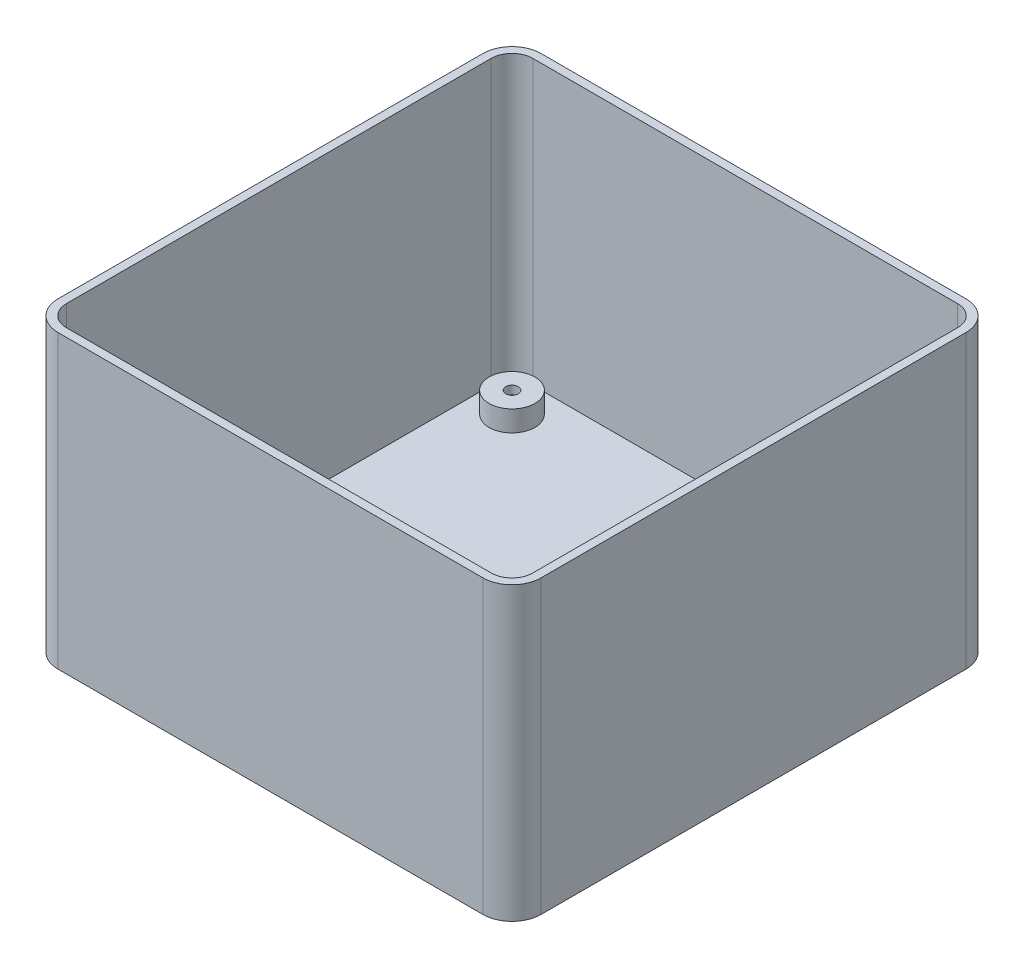
ISO-10303-21;
HEADER;
FILE_DESCRIPTION(('STEP AP214'),'2;1');
FILE_NAME('part.step','',(''),(''),'','','');
FILE_SCHEMA(('AUTOMOTIVE_DESIGN { 1 0 10303 214 1 1 1 1 }'));
ENDSEC;
DATA;
#1=APPLICATION_CONTEXT('core data for automotive mechanical design processes');
#2=APPLICATION_PROTOCOL_DEFINITION('international standard','automotive_design',2000,#1);
#3=PRODUCT_CONTEXT('',#1,'mechanical');
#4=PRODUCT('Part','Part','',(#3));
#5=PRODUCT_RELATED_PRODUCT_CATEGORY('part','',(#4));
#6=PRODUCT_DEFINITION_FORMATION('','',#4);
#7=PRODUCT_DEFINITION_CONTEXT('part definition',#1,'design');
#8=PRODUCT_DEFINITION('design','',#6,#7);
#9=PRODUCT_DEFINITION_SHAPE('','',#8);
#10=(LENGTH_UNIT() NAMED_UNIT(*) SI_UNIT(.MILLI.,.METRE.));
#11=(NAMED_UNIT(*) PLANE_ANGLE_UNIT() SI_UNIT($,.RADIAN.));
#12=(NAMED_UNIT(*) SI_UNIT($,.STERADIAN.) SOLID_ANGLE_UNIT());
#13=UNCERTAINTY_MEASURE_WITH_UNIT(LENGTH_MEASURE(1.E-05),#10,'distance_accuracy_value','');
#14=(GEOMETRIC_REPRESENTATION_CONTEXT(3) GLOBAL_UNCERTAINTY_ASSIGNED_CONTEXT((#13)) GLOBAL_UNIT_ASSIGNED_CONTEXT((#10,
#11,#12)) REPRESENTATION_CONTEXT('',''));
#15=CARTESIAN_POINT('',(0.,0.,0.));
#16=DIRECTION('',(0.,0.,1.));
#17=DIRECTION('',(1.,0.,0.));
#18=AXIS2_PLACEMENT_3D('',#15,#16,#17);
#19=CARTESIAN_POINT('',(-51.,70.,-51.));
#20=DIRECTION('',(0.,-1.,0.));
#21=DIRECTION('',(0.,0.,-1.));
#22=AXIS2_PLACEMENT_3D('',#19,#20,#21);
#23=PLANE('',#22);
#24=CARTESIAN_POINT('',(-51.,70.,-51.));
#25=DIRECTION('',(0.,1.,0.));
#26=DIRECTION('',(0.,0.,-1.));
#27=AXIS2_PLACEMENT_3D('',#24,#25,#26);
#28=CIRCLE('',#27,7.);
#29=CARTESIAN_POINT('',(-51.,70.,-58.));
#30=VERTEX_POINT('',#29);
#31=CARTESIAN_POINT('',(-58.,70.,-51.));
#32=VERTEX_POINT('',#31);
#33=EDGE_CURVE('E253',#30,#32,#28,.T.);
#34=ORIENTED_EDGE('',*,*,#33,.T.);
#35=DIRECTION('',(0.,0.,1.));
#36=VECTOR('',#35,1.);
#37=CARTESIAN_POINT('',(-58.,70.,51.));
#38=LINE('',#37,#36);
#39=CARTESIAN_POINT('',(-58.,70.,51.));
#40=VERTEX_POINT('',#39);
#41=EDGE_CURVE('E257',#32,#40,#38,.T.);
#42=ORIENTED_EDGE('',*,*,#41,.T.);
#43=CARTESIAN_POINT('',(-51.,70.,51.));
#44=DIRECTION('',(0.,1.,0.));
#45=DIRECTION('',(0.,0.,-1.));
#46=AXIS2_PLACEMENT_3D('',#43,#44,#45);
#47=CIRCLE('',#46,7.);
#48=CARTESIAN_POINT('',(-51.,70.,58.));
#49=VERTEX_POINT('',#48);
#50=EDGE_CURVE('E261',#40,#49,#47,.T.);
#51=ORIENTED_EDGE('',*,*,#50,.T.);
#52=DIRECTION('',(1.,0.,0.));
#53=VECTOR('',#52,1.);
#54=CARTESIAN_POINT('',(-51.,70.,58.));
#55=LINE('',#54,#53);
#56=CARTESIAN_POINT('',(51.,70.,58.));
#57=VERTEX_POINT('',#56);
#58=EDGE_CURVE('E264',#49,#57,#55,.T.);
#59=ORIENTED_EDGE('',*,*,#58,.T.);
#60=CARTESIAN_POINT('',(51.,70.,51.));
#61=DIRECTION('',(0.,1.,0.));
#62=DIRECTION('',(0.,0.,1.));
#63=AXIS2_PLACEMENT_3D('',#60,#61,#62);
#64=CIRCLE('',#63,7.);
#65=CARTESIAN_POINT('',(58.,70.,51.));
#66=VERTEX_POINT('',#65);
#67=EDGE_CURVE('E267',#57,#66,#64,.T.);
#68=ORIENTED_EDGE('',*,*,#67,.T.);
#69=DIRECTION('',(0.,0.,-1.));
#70=VECTOR('',#69,1.);
#71=CARTESIAN_POINT('',(58.,70.,51.));
#72=LINE('',#71,#70);
#73=CARTESIAN_POINT('',(58.,70.,-51.));
#74=VERTEX_POINT('',#73);
#75=EDGE_CURVE('E270',#66,#74,#72,.T.);
#76=ORIENTED_EDGE('',*,*,#75,.T.);
#77=CARTESIAN_POINT('',(51.,70.,-51.));
#78=DIRECTION('',(0.,1.,0.));
#79=DIRECTION('',(0.,0.,-1.));
#80=AXIS2_PLACEMENT_3D('',#77,#78,#79);
#81=CIRCLE('',#80,7.);
#82=CARTESIAN_POINT('',(51.,70.,-58.));
#83=VERTEX_POINT('',#82);
#84=EDGE_CURVE('E273',#74,#83,#81,.T.);
#85=ORIENTED_EDGE('',*,*,#84,.T.);
#86=DIRECTION('',(-1.,0.,0.));
#87=VECTOR('',#86,1.);
#88=CARTESIAN_POINT('',(-51.,70.,-58.));
#89=LINE('',#88,#87);
#90=EDGE_CURVE('E276',#83,#30,#89,.T.);
#91=ORIENTED_EDGE('',*,*,#90,.T.);
#92=EDGE_LOOP('',(#34,#42,#51,#59,#68,#76,#85,#91));
#93=FACE_BOUND('',#92,.T.);
#94=CARTESIAN_POINT('',(-51.,70.,51.));
#95=DIRECTION('',(0.,1.,0.));
#96=DIRECTION('',(0.,0.,-1.));
#97=AXIS2_PLACEMENT_3D('',#94,#95,#96);
#98=CIRCLE('',#97,5.);
#99=CARTESIAN_POINT('',(-56.,70.,51.));
#100=VERTEX_POINT('',#99);
#101=CARTESIAN_POINT('',(-51.,70.,56.));
#102=VERTEX_POINT('',#101);
#103=EDGE_CURVE('E175',#100,#102,#98,.T.);
#104=ORIENTED_EDGE('',*,*,#103,.F.);
#105=DIRECTION('',(0.,0.,1.));
#106=VECTOR('',#105,1.);
#107=CARTESIAN_POINT('',(-56.,70.,51.));
#108=LINE('',#107,#106);
#109=CARTESIAN_POINT('',(-56.,70.,-51.));
#110=VERTEX_POINT('',#109);
#111=EDGE_CURVE('E163',#110,#100,#108,.T.);
#112=ORIENTED_EDGE('',*,*,#111,.F.);
#113=CARTESIAN_POINT('',(-51.,70.,-51.));
#114=DIRECTION('',(0.,1.,0.));
#115=DIRECTION('',(0.,0.,-1.));
#116=AXIS2_PLACEMENT_3D('',#113,#114,#115);
#117=CIRCLE('',#116,5.);
#118=CARTESIAN_POINT('',(-51.,70.,-56.));
#119=VERTEX_POINT('',#118);
#120=EDGE_CURVE('E225',#119,#110,#117,.T.);
#121=ORIENTED_EDGE('',*,*,#120,.F.);
#122=DIRECTION('',(-1.,0.,0.));
#123=VECTOR('',#122,1.);
#124=CARTESIAN_POINT('',(-51.,70.,-56.));
#125=LINE('',#124,#123);
#126=CARTESIAN_POINT('',(51.,70.,-56.));
#127=VERTEX_POINT('',#126);
#128=EDGE_CURVE('E222',#127,#119,#125,.T.);
#129=ORIENTED_EDGE('',*,*,#128,.F.);
#130=CARTESIAN_POINT('',(51.,70.,-51.));
#131=DIRECTION('',(0.,1.,0.));
#132=DIRECTION('',(0.,0.,-1.));
#133=AXIS2_PLACEMENT_3D('',#130,#131,#132);
#134=CIRCLE('',#133,5.);
#135=CARTESIAN_POINT('',(56.,70.,-51.));
#136=VERTEX_POINT('',#135);
#137=EDGE_CURVE('E219',#136,#127,#134,.T.);
#138=ORIENTED_EDGE('',*,*,#137,.F.);
#139=DIRECTION('',(0.,0.,-1.));
#140=VECTOR('',#139,1.);
#141=CARTESIAN_POINT('',(56.,70.,51.));
#142=LINE('',#141,#140);
#143=CARTESIAN_POINT('',(56.,70.,51.));
#144=VERTEX_POINT('',#143);
#145=EDGE_CURVE('E216',#144,#136,#142,.T.);
#146=ORIENTED_EDGE('',*,*,#145,.F.);
#147=CARTESIAN_POINT('',(51.,70.,51.));
#148=DIRECTION('',(0.,1.,0.));
#149=DIRECTION('',(0.,0.,1.));
#150=AXIS2_PLACEMENT_3D('',#147,#148,#149);
#151=CIRCLE('',#150,5.);
#152=CARTESIAN_POINT('',(51.,70.,56.));
#153=VERTEX_POINT('',#152);
#154=EDGE_CURVE('E213',#153,#144,#151,.T.);
#155=ORIENTED_EDGE('',*,*,#154,.F.);
#156=DIRECTION('',(1.,0.,0.));
#157=VECTOR('',#156,1.);
#158=CARTESIAN_POINT('',(-51.,70.,56.));
#159=LINE('',#158,#157);
#160=EDGE_CURVE('E210',#102,#153,#159,.T.);
#161=ORIENTED_EDGE('',*,*,#160,.F.);
#162=EDGE_LOOP('',(#104,#112,#121,#129,#138,#146,#155,#161));
#163=FACE_BOUND('',#162,.T.);
#164=ADVANCED_FACE('F41',(#93,#163),#23,.F.);
#165=CARTESIAN_POINT('',(-51.,0.,-51.));
#166=DIRECTION('',(0.,-1.,0.));
#167=DIRECTION('',(0.,0.,-1.));
#168=AXIS2_PLACEMENT_3D('',#165,#166,#167);
#169=PLANE('',#168);
#170=CARTESIAN_POINT('',(-47.5,0.,-47.5));
#171=DIRECTION('',(0.,1.,0.));
#172=DIRECTION('',(0.,0.,1.));
#173=AXIS2_PLACEMENT_3D('',#170,#171,#172);
#174=CIRCLE('',#173,4.5);
#175=CARTESIAN_POINT('',(-47.5,0.,-43.));
#176=VERTEX_POINT('',#175);
#177=EDGE_CURVE('E592',#176,#176,#174,.T.);
#178=ORIENTED_EDGE('',*,*,#177,.T.);
#179=EDGE_LOOP('',(#178));
#180=FACE_BOUND('',#179,.T.);
#181=CARTESIAN_POINT('',(-51.,0.,-51.));
#182=DIRECTION('',(0.,1.,0.));
#183=DIRECTION('',(0.,0.,-1.));
#184=AXIS2_PLACEMENT_3D('',#181,#182,#183);
#185=CIRCLE('',#184,7.);
#186=CARTESIAN_POINT('',(-51.,0.,-58.));
#187=VERTEX_POINT('',#186);
#188=CARTESIAN_POINT('',(-58.,0.,-51.));
#189=VERTEX_POINT('',#188);
#190=EDGE_CURVE('E252',#187,#189,#185,.T.);
#191=ORIENTED_EDGE('',*,*,#190,.F.);
#192=DIRECTION('',(-1.,0.,0.));
#193=VECTOR('',#192,1.);
#194=CARTESIAN_POINT('',(-51.,0.,-58.));
#195=LINE('',#194,#193);
#196=CARTESIAN_POINT('',(51.,0.,-58.));
#197=VERTEX_POINT('',#196);
#198=EDGE_CURVE('E258',#197,#187,#195,.T.);
#199=ORIENTED_EDGE('',*,*,#198,.F.);
#200=CARTESIAN_POINT('',(51.,0.,-51.));
#201=DIRECTION('',(0.,1.,0.));
#202=DIRECTION('',(0.,0.,-1.));
#203=AXIS2_PLACEMENT_3D('',#200,#201,#202);
#204=CIRCLE('',#203,7.);
#205=CARTESIAN_POINT('',(58.,0.,-51.));
#206=VERTEX_POINT('',#205);
#207=EDGE_CURVE('E303',#206,#197,#204,.T.);
#208=ORIENTED_EDGE('',*,*,#207,.F.);
#209=DIRECTION('',(0.,0.,-1.));
#210=VECTOR('',#209,1.);
#211=CARTESIAN_POINT('',(58.,0.,51.));
#212=LINE('',#211,#210);
#213=CARTESIAN_POINT('',(58.,0.,51.));
#214=VERTEX_POINT('',#213);
#215=EDGE_CURVE('E299',#214,#206,#212,.T.);
#216=ORIENTED_EDGE('',*,*,#215,.F.);
#217=CARTESIAN_POINT('',(51.,0.,51.));
#218=DIRECTION('',(0.,1.,0.));
#219=DIRECTION('',(0.,0.,1.));
#220=AXIS2_PLACEMENT_3D('',#217,#218,#219);
#221=CIRCLE('',#220,7.);
#222=CARTESIAN_POINT('',(51.,0.,58.));
#223=VERTEX_POINT('',#222);
#224=EDGE_CURVE('E295',#223,#214,#221,.T.);
#225=ORIENTED_EDGE('',*,*,#224,.F.);
#226=DIRECTION('',(1.,0.,0.));
#227=VECTOR('',#226,1.);
#228=CARTESIAN_POINT('',(-51.,0.,58.));
#229=LINE('',#228,#227);
#230=CARTESIAN_POINT('',(-51.,0.,58.));
#231=VERTEX_POINT('',#230);
#232=EDGE_CURVE('E291',#231,#223,#229,.T.);
#233=ORIENTED_EDGE('',*,*,#232,.F.);
#234=CARTESIAN_POINT('',(-51.,0.,51.));
#235=DIRECTION('',(0.,1.,0.));
#236=DIRECTION('',(0.,0.,-1.));
#237=AXIS2_PLACEMENT_3D('',#234,#235,#236);
#238=CIRCLE('',#237,7.);
#239=CARTESIAN_POINT('',(-58.,0.,51.));
#240=VERTEX_POINT('',#239);
#241=EDGE_CURVE('E287',#240,#231,#238,.T.);
#242=ORIENTED_EDGE('',*,*,#241,.F.);
#243=DIRECTION('',(0.,0.,1.));
#244=VECTOR('',#243,1.);
#245=CARTESIAN_POINT('',(-58.,0.,51.));
#246=LINE('',#245,#244);
#247=EDGE_CURVE('E283',#189,#240,#246,.T.);
#248=ORIENTED_EDGE('',*,*,#247,.F.);
#249=EDGE_LOOP('',(#191,#199,#208,#216,#225,#233,#242,#248));
#250=FACE_BOUND('',#249,.T.);
#251=ADVANCED_FACE('F341',(#180,#250),#169,.T.);
#252=CARTESIAN_POINT('',(-51.,70.,-51.));
#253=DIRECTION('',(0.,-1.,0.));
#254=DIRECTION('',(0.,0.,-1.));
#255=AXIS2_PLACEMENT_3D('',#252,#253,#254);
#256=CYLINDRICAL_SURFACE('',#255,7.);
#257=DIRECTION('',(0.,-1.,0.));
#258=VECTOR('',#257,1.);
#259=CARTESIAN_POINT('',(-51.,70.,-58.));
#260=LINE('',#259,#258);
#261=EDGE_CURVE('E279',#30,#187,#260,.T.);
#262=ORIENTED_EDGE('',*,*,#261,.T.);
#263=ORIENTED_EDGE('',*,*,#190,.T.);
#264=DIRECTION('',(0.,-1.,0.));
#265=VECTOR('',#264,1.);
#266=CARTESIAN_POINT('',(-58.,70.,-51.));
#267=LINE('',#266,#265);
#268=EDGE_CURVE('E51',#32,#189,#267,.T.);
#269=ORIENTED_EDGE('',*,*,#268,.F.);
#270=ORIENTED_EDGE('',*,*,#33,.F.);
#271=EDGE_LOOP('',(#262,#263,#269,#270));
#272=FACE_BOUND('',#271,.T.);
#273=ADVANCED_FACE('F43',(#272),#256,.T.);
#274=CARTESIAN_POINT('',(-58.,70.,51.));
#275=DIRECTION('',(1.,0.,0.));
#276=DIRECTION('',(0.,0.,-1.));
#277=AXIS2_PLACEMENT_3D('',#274,#275,#276);
#278=PLANE('',#277);
#279=ORIENTED_EDGE('',*,*,#268,.T.);
#280=ORIENTED_EDGE('',*,*,#247,.T.);
#281=DIRECTION('',(0.,-1.,0.));
#282=VECTOR('',#281,1.);
#283=CARTESIAN_POINT('',(-58.,70.,51.));
#284=LINE('',#283,#282);
#285=EDGE_CURVE('E327',#40,#240,#284,.T.);
#286=ORIENTED_EDGE('',*,*,#285,.F.);
#287=ORIENTED_EDGE('',*,*,#41,.F.);
#288=EDGE_LOOP('',(#279,#280,#286,#287));
#289=FACE_BOUND('',#288,.T.);
#290=ADVANCED_FACE('F334',(#289),#278,.F.);
#291=CARTESIAN_POINT('',(-51.,70.,51.));
#292=DIRECTION('',(0.,-1.,0.));
#293=DIRECTION('',(0.,0.,-1.));
#294=AXIS2_PLACEMENT_3D('',#291,#292,#293);
#295=CYLINDRICAL_SURFACE('',#294,7.);
#296=ORIENTED_EDGE('',*,*,#285,.T.);
#297=ORIENTED_EDGE('',*,*,#241,.T.);
#298=DIRECTION('',(0.,-1.,0.));
#299=VECTOR('',#298,1.);
#300=CARTESIAN_POINT('',(-51.,70.,58.));
#301=LINE('',#300,#299);
#302=EDGE_CURVE('E324',#49,#231,#301,.T.);
#303=ORIENTED_EDGE('',*,*,#302,.F.);
#304=ORIENTED_EDGE('',*,*,#50,.F.);
#305=EDGE_LOOP('',(#296,#297,#303,#304));
#306=FACE_BOUND('',#305,.T.);
#307=ADVANCED_FACE('F370',(#306),#295,.T.);
#308=CARTESIAN_POINT('',(-51.,70.,58.));
#309=DIRECTION('',(0.,0.,-1.));
#310=DIRECTION('',(-1.,0.,0.));
#311=AXIS2_PLACEMENT_3D('',#308,#309,#310);
#312=PLANE('',#311);
#313=ORIENTED_EDGE('',*,*,#302,.T.);
#314=ORIENTED_EDGE('',*,*,#232,.T.);
#315=DIRECTION('',(0.,-1.,0.));
#316=VECTOR('',#315,1.);
#317=CARTESIAN_POINT('',(51.,70.,58.));
#318=LINE('',#317,#316);
#319=EDGE_CURVE('E321',#57,#223,#318,.T.);
#320=ORIENTED_EDGE('',*,*,#319,.F.);
#321=ORIENTED_EDGE('',*,*,#58,.F.);
#322=EDGE_LOOP('',(#313,#314,#320,#321));
#323=FACE_BOUND('',#322,.T.);
#324=ADVANCED_FACE('F365',(#323),#312,.F.);
#325=CARTESIAN_POINT('',(51.,70.,51.));
#326=DIRECTION('',(0.,-1.,0.));
#327=DIRECTION('',(0.,0.,-1.));
#328=AXIS2_PLACEMENT_3D('',#325,#326,#327);
#329=CYLINDRICAL_SURFACE('',#328,7.);
#330=ORIENTED_EDGE('',*,*,#319,.T.);
#331=ORIENTED_EDGE('',*,*,#224,.T.);
#332=DIRECTION('',(0.,-1.,0.));
#333=VECTOR('',#332,1.);
#334=CARTESIAN_POINT('',(58.,70.,51.));
#335=LINE('',#334,#333);
#336=EDGE_CURVE('E318',#66,#214,#335,.T.);
#337=ORIENTED_EDGE('',*,*,#336,.F.);
#338=ORIENTED_EDGE('',*,*,#67,.F.);
#339=EDGE_LOOP('',(#330,#331,#337,#338));
#340=FACE_BOUND('',#339,.T.);
#341=ADVANCED_FACE('F362',(#340),#329,.T.);
#342=CARTESIAN_POINT('',(58.,70.,51.));
#343=DIRECTION('',(-1.,0.,0.));
#344=DIRECTION('',(0.,0.,1.));
#345=AXIS2_PLACEMENT_3D('',#342,#343,#344);
#346=PLANE('',#345);
#347=ORIENTED_EDGE('',*,*,#336,.T.);
#348=ORIENTED_EDGE('',*,*,#215,.T.);
#349=DIRECTION('',(0.,-1.,0.));
#350=VECTOR('',#349,1.);
#351=CARTESIAN_POINT('',(58.,70.,-51.));
#352=LINE('',#351,#350);
#353=EDGE_CURVE('E315',#74,#206,#352,.T.);
#354=ORIENTED_EDGE('',*,*,#353,.F.);
#355=ORIENTED_EDGE('',*,*,#75,.F.);
#356=EDGE_LOOP('',(#347,#348,#354,#355));
#357=FACE_BOUND('',#356,.T.);
#358=ADVANCED_FACE('F358',(#357),#346,.F.);
#359=CARTESIAN_POINT('',(51.,70.,-51.));
#360=DIRECTION('',(0.,-1.,0.));
#361=DIRECTION('',(0.,0.,-1.));
#362=AXIS2_PLACEMENT_3D('',#359,#360,#361);
#363=CYLINDRICAL_SURFACE('',#362,7.);
#364=ORIENTED_EDGE('',*,*,#353,.T.);
#365=ORIENTED_EDGE('',*,*,#207,.T.);
#366=DIRECTION('',(0.,-1.,0.));
#367=VECTOR('',#366,1.);
#368=CARTESIAN_POINT('',(51.,70.,-58.));
#369=LINE('',#368,#367);
#370=EDGE_CURVE('E312',#83,#197,#369,.T.);
#371=ORIENTED_EDGE('',*,*,#370,.F.);
#372=ORIENTED_EDGE('',*,*,#84,.F.);
#373=EDGE_LOOP('',(#364,#365,#371,#372));
#374=FACE_BOUND('',#373,.T.);
#375=ADVANCED_FACE('F353',(#374),#363,.T.);
#376=CARTESIAN_POINT('',(-51.,70.,-58.));
#377=DIRECTION('',(0.,0.,1.));
#378=DIRECTION('',(1.,0.,0.));
#379=AXIS2_PLACEMENT_3D('',#376,#377,#378);
#380=PLANE('',#379);
#381=ORIENTED_EDGE('',*,*,#370,.T.);
#382=ORIENTED_EDGE('',*,*,#198,.T.);
#383=ORIENTED_EDGE('',*,*,#261,.F.);
#384=ORIENTED_EDGE('',*,*,#90,.F.);
#385=EDGE_LOOP('',(#381,#382,#383,#384));
#386=FACE_BOUND('',#385,.T.);
#387=ADVANCED_FACE('F347',(#386),#380,.F.);
#388=CARTESIAN_POINT('',(-51.,70.,51.));
#389=DIRECTION('',(0.,-1.,0.));
#390=DIRECTION('',(0.,0.,-1.));
#391=AXIS2_PLACEMENT_3D('',#388,#389,#390);
#392=CYLINDRICAL_SURFACE('',#391,5.);
#393=CARTESIAN_POINT('',(-51.,2.,51.));
#394=DIRECTION('',(0.,1.,0.));
#395=DIRECTION('',(0.,0.,1.));
#396=AXIS2_PLACEMENT_3D('',#393,#394,#395);
#397=CIRCLE('',#396,5.);
#398=CARTESIAN_POINT('',(-56.,2.,51.));
#399=VERTEX_POINT('',#398);
#400=CARTESIAN_POINT('',(-51.,2.,56.));
#401=VERTEX_POINT('',#400);
#402=EDGE_CURVE('E170',#399,#401,#397,.T.);
#403=ORIENTED_EDGE('',*,*,#402,.F.);
#404=DIRECTION('',(0.,-1.,0.));
#405=VECTOR('',#404,1.);
#406=CARTESIAN_POINT('',(-56.,70.,51.));
#407=LINE('',#406,#405);
#408=EDGE_CURVE('E158',#100,#399,#407,.T.);
#409=ORIENTED_EDGE('',*,*,#408,.F.);
#410=ORIENTED_EDGE('',*,*,#103,.T.);
#411=DIRECTION('',(0.,-1.,0.));
#412=VECTOR('',#411,1.);
#413=CARTESIAN_POINT('',(-51.,70.,56.));
#414=LINE('',#413,#412);
#415=EDGE_CURVE('E172',#102,#401,#414,.T.);
#416=ORIENTED_EDGE('',*,*,#415,.T.);
#417=EDGE_LOOP('',(#403,#409,#410,#416));
#418=FACE_BOUND('',#417,.T.);
#419=ADVANCED_FACE('F171',(#418),#392,.F.);
#420=CARTESIAN_POINT('',(-51.,70.,56.));
#421=DIRECTION('',(0.,0.,-1.));
#422=DIRECTION('',(-1.,0.,0.));
#423=AXIS2_PLACEMENT_3D('',#420,#421,#422);
#424=PLANE('',#423);
#425=DIRECTION('',(1.,0.,0.));
#426=VECTOR('',#425,1.);
#427=CARTESIAN_POINT('',(-51.,2.,56.));
#428=LINE('',#427,#426);
#429=CARTESIAN_POINT('',(51.,2.,56.));
#430=VERTEX_POINT('',#429);
#431=EDGE_CURVE('E58',#401,#430,#428,.T.);
#432=ORIENTED_EDGE('',*,*,#431,.F.);
#433=ORIENTED_EDGE('',*,*,#415,.F.);
#434=ORIENTED_EDGE('',*,*,#160,.T.);
#435=DIRECTION('',(0.,-1.,0.));
#436=VECTOR('',#435,1.);
#437=CARTESIAN_POINT('',(51.,70.,56.));
#438=LINE('',#437,#436);
#439=EDGE_CURVE('E247',#153,#430,#438,.T.);
#440=ORIENTED_EDGE('',*,*,#439,.T.);
#441=EDGE_LOOP('',(#432,#433,#434,#440));
#442=FACE_BOUND('',#441,.T.);
#443=ADVANCED_FACE('F378',(#442),#424,.T.);
#444=CARTESIAN_POINT('',(51.,70.,51.));
#445=DIRECTION('',(0.,-1.,0.));
#446=DIRECTION('',(0.,0.,-1.));
#447=AXIS2_PLACEMENT_3D('',#444,#445,#446);
#448=CYLINDRICAL_SURFACE('',#447,5.);
#449=CARTESIAN_POINT('',(51.,2.,51.));
#450=DIRECTION('',(0.,1.,0.));
#451=DIRECTION('',(0.,0.,1.));
#452=AXIS2_PLACEMENT_3D('',#449,#450,#451);
#453=CIRCLE('',#452,5.);
#454=CARTESIAN_POINT('',(56.,2.,51.));
#455=VERTEX_POINT('',#454);
#456=EDGE_CURVE('E66',#430,#455,#453,.T.);
#457=ORIENTED_EDGE('',*,*,#456,.F.);
#458=ORIENTED_EDGE('',*,*,#439,.F.);
#459=ORIENTED_EDGE('',*,*,#154,.T.);
#460=DIRECTION('',(0.,-1.,0.));
#461=VECTOR('',#460,1.);
#462=CARTESIAN_POINT('',(56.,70.,51.));
#463=LINE('',#462,#461);
#464=EDGE_CURVE('E244',#144,#455,#463,.T.);
#465=ORIENTED_EDGE('',*,*,#464,.T.);
#466=EDGE_LOOP('',(#457,#458,#459,#465));
#467=FACE_BOUND('',#466,.T.);
#468=ADVANCED_FACE('F379',(#467),#448,.F.);
#469=CARTESIAN_POINT('',(56.,70.,51.));
#470=DIRECTION('',(-1.,0.,0.));
#471=DIRECTION('',(0.,0.,1.));
#472=AXIS2_PLACEMENT_3D('',#469,#470,#471);
#473=PLANE('',#472);
#474=DIRECTION('',(0.,0.,-1.));
#475=VECTOR('',#474,1.);
#476=CARTESIAN_POINT('',(56.,2.,51.));
#477=LINE('',#476,#475);
#478=CARTESIAN_POINT('',(56.,2.,-51.));
#479=VERTEX_POINT('',#478);
#480=EDGE_CURVE('E200',#455,#479,#477,.T.);
#481=ORIENTED_EDGE('',*,*,#480,.F.);
#482=ORIENTED_EDGE('',*,*,#464,.F.);
#483=ORIENTED_EDGE('',*,*,#145,.T.);
#484=DIRECTION('',(0.,-1.,0.));
#485=VECTOR('',#484,1.);
#486=CARTESIAN_POINT('',(56.,70.,-51.));
#487=LINE('',#486,#485);
#488=EDGE_CURVE('E240',#136,#479,#487,.T.);
#489=ORIENTED_EDGE('',*,*,#488,.T.);
#490=EDGE_LOOP('',(#481,#482,#483,#489));
#491=FACE_BOUND('',#490,.T.);
#492=ADVANCED_FACE('F386',(#491),#473,.T.);
#493=CARTESIAN_POINT('',(51.,70.,-51.));
#494=DIRECTION('',(0.,-1.,0.));
#495=DIRECTION('',(0.,0.,-1.));
#496=AXIS2_PLACEMENT_3D('',#493,#494,#495);
#497=CYLINDRICAL_SURFACE('',#496,5.);
#498=CARTESIAN_POINT('',(51.,2.,-51.));
#499=DIRECTION('',(0.,1.,0.));
#500=DIRECTION('',(0.,0.,1.));
#501=AXIS2_PLACEMENT_3D('',#498,#499,#500);
#502=CIRCLE('',#501,5.);
#503=CARTESIAN_POINT('',(51.,2.,-56.));
#504=VERTEX_POINT('',#503);
#505=EDGE_CURVE('E191',#479,#504,#502,.T.);
#506=ORIENTED_EDGE('',*,*,#505,.F.);
#507=ORIENTED_EDGE('',*,*,#488,.F.);
#508=ORIENTED_EDGE('',*,*,#137,.T.);
#509=DIRECTION('',(0.,-1.,0.));
#510=VECTOR('',#509,1.);
#511=CARTESIAN_POINT('',(51.,70.,-56.));
#512=LINE('',#511,#510);
#513=EDGE_CURVE('E236',#127,#504,#512,.T.);
#514=ORIENTED_EDGE('',*,*,#513,.T.);
#515=EDGE_LOOP('',(#506,#507,#508,#514));
#516=FACE_BOUND('',#515,.T.);
#517=ADVANCED_FACE('F388',(#516),#497,.F.);
#518=CARTESIAN_POINT('',(-51.,70.,-56.));
#519=DIRECTION('',(0.,0.,1.));
#520=DIRECTION('',(1.,0.,0.));
#521=AXIS2_PLACEMENT_3D('',#518,#519,#520);
#522=PLANE('',#521);
#523=DIRECTION('',(-1.,0.,0.));
#524=VECTOR('',#523,1.);
#525=CARTESIAN_POINT('',(-51.,2.,-56.));
#526=LINE('',#525,#524);
#527=CARTESIAN_POINT('',(-51.,2.,-56.));
#528=VERTEX_POINT('',#527);
#529=EDGE_CURVE('E182',#504,#528,#526,.T.);
#530=ORIENTED_EDGE('',*,*,#529,.F.);
#531=ORIENTED_EDGE('',*,*,#513,.F.);
#532=ORIENTED_EDGE('',*,*,#128,.T.);
#533=DIRECTION('',(0.,-1.,0.));
#534=VECTOR('',#533,1.);
#535=CARTESIAN_POINT('',(-51.,70.,-56.));
#536=LINE('',#535,#534);
#537=EDGE_CURVE('E233',#119,#528,#536,.T.);
#538=ORIENTED_EDGE('',*,*,#537,.T.);
#539=EDGE_LOOP('',(#530,#531,#532,#538));
#540=FACE_BOUND('',#539,.T.);
#541=ADVANCED_FACE('F391',(#540),#522,.T.);
#542=CARTESIAN_POINT('',(-51.,70.,-51.));
#543=DIRECTION('',(0.,-1.,0.));
#544=DIRECTION('',(0.,0.,-1.));
#545=AXIS2_PLACEMENT_3D('',#542,#543,#544);
#546=CYLINDRICAL_SURFACE('',#545,5.);
#547=CARTESIAN_POINT('',(-51.,2.,-51.));
#548=DIRECTION('',(0.,1.,0.));
#549=DIRECTION('',(0.,0.,1.));
#550=AXIS2_PLACEMENT_3D('',#547,#548,#549);
#551=CIRCLE('',#550,5.);
#552=CARTESIAN_POINT('',(-56.,2.,-51.));
#553=VERTEX_POINT('',#552);
#554=EDGE_CURVE('E180',#528,#553,#551,.T.);
#555=ORIENTED_EDGE('',*,*,#554,.F.);
#556=ORIENTED_EDGE('',*,*,#537,.F.);
#557=ORIENTED_EDGE('',*,*,#120,.T.);
#558=DIRECTION('',(0.,-1.,0.));
#559=VECTOR('',#558,1.);
#560=CARTESIAN_POINT('',(-56.,70.,-51.));
#561=LINE('',#560,#559);
#562=EDGE_CURVE('E167',#110,#553,#561,.T.);
#563=ORIENTED_EDGE('',*,*,#562,.T.);
#564=EDGE_LOOP('',(#555,#556,#557,#563));
#565=FACE_BOUND('',#564,.T.);
#566=ADVANCED_FACE('F392',(#565),#546,.F.);
#567=CARTESIAN_POINT('',(-56.,70.,51.));
#568=DIRECTION('',(1.,0.,0.));
#569=DIRECTION('',(0.,0.,-1.));
#570=AXIS2_PLACEMENT_3D('',#567,#568,#569);
#571=PLANE('',#570);
#572=DIRECTION('',(0.,0.,1.));
#573=VECTOR('',#572,1.);
#574=CARTESIAN_POINT('',(-56.,2.,51.));
#575=LINE('',#574,#573);
#576=EDGE_CURVE('E12',#553,#399,#575,.T.);
#577=ORIENTED_EDGE('',*,*,#576,.F.);
#578=ORIENTED_EDGE('',*,*,#562,.F.);
#579=ORIENTED_EDGE('',*,*,#111,.T.);
#580=ORIENTED_EDGE('',*,*,#408,.T.);
#581=EDGE_LOOP('',(#577,#578,#579,#580));
#582=FACE_BOUND('',#581,.T.);
#583=ADVANCED_FACE('F160',(#582),#571,.T.);
#584=CARTESIAN_POINT('',(-51.,2.,-51.));
#585=DIRECTION('',(0.,1.,0.));
#586=DIRECTION('',(0.,0.,1.));
#587=AXIS2_PLACEMENT_3D('',#584,#585,#586);
#588=PLANE('',#587);
#589=CARTESIAN_POINT('',(-47.5,2.,-47.5));
#590=DIRECTION('',(0.,1.,0.));
#591=DIRECTION('',(0.,0.,1.));
#592=AXIS2_PLACEMENT_3D('',#589,#590,#591);
#593=CIRCLE('',#592,5.5);
#594=CARTESIAN_POINT('',(-47.5,2.,-42.));
#595=VERTEX_POINT('',#594);
#596=EDGE_CURVE('E194',#595,#595,#593,.T.);
#597=ORIENTED_EDGE('',*,*,#596,.F.);
#598=EDGE_LOOP('',(#597));
#599=FACE_BOUND('',#598,.T.);
#600=ORIENTED_EDGE('',*,*,#576,.T.);
#601=ORIENTED_EDGE('',*,*,#402,.T.);
#602=ORIENTED_EDGE('',*,*,#431,.T.);
#603=ORIENTED_EDGE('',*,*,#456,.T.);
#604=ORIENTED_EDGE('',*,*,#480,.T.);
#605=ORIENTED_EDGE('',*,*,#505,.T.);
#606=ORIENTED_EDGE('',*,*,#529,.T.);
#607=ORIENTED_EDGE('',*,*,#554,.T.);
#608=EDGE_LOOP('',(#600,#601,#602,#603,#604,#605,#606,#607));
#609=FACE_BOUND('',#608,.T.);
#610=ADVANCED_FACE('F178',(#599,#609),#588,.T.);
#611=CARTESIAN_POINT('',(-47.5,7.,-47.5));
#612=DIRECTION('',(0.,1.,0.));
#613=DIRECTION('',(0.,0.,1.));
#614=AXIS2_PLACEMENT_3D('',#611,#612,#613);
#615=PLANE('',#614);
#616=CARTESIAN_POINT('',(-47.5,7.,-47.5));
#617=DIRECTION('',(0.,1.,0.));
#618=DIRECTION('',(0.,0.,1.));
#619=AXIS2_PLACEMENT_3D('',#616,#617,#618);
#620=CIRCLE('',#619,5.5);
#621=CARTESIAN_POINT('',(-47.5,7.,-42.));
#622=VERTEX_POINT('',#621);
#623=EDGE_CURVE('E187',#622,#622,#620,.T.);
#624=ORIENTED_EDGE('',*,*,#623,.T.);
#625=EDGE_LOOP('',(#624));
#626=FACE_BOUND('',#625,.T.);
#627=CARTESIAN_POINT('',(-47.5,7.,-47.5));
#628=DIRECTION('',(0.,1.,0.));
#629=DIRECTION('',(0.,0.,1.));
#630=AXIS2_PLACEMENT_3D('',#627,#628,#629);
#631=CIRCLE('',#630,1.5);
#632=CARTESIAN_POINT('',(-47.5,7.,-46.));
#633=VERTEX_POINT('',#632);
#634=EDGE_CURVE('E596',#633,#633,#631,.T.);
#635=ORIENTED_EDGE('',*,*,#634,.F.);
#636=EDGE_LOOP('',(#635));
#637=FACE_BOUND('',#636,.T.);
#638=ADVANCED_FACE('F533',(#626,#637),#615,.T.);
#639=CARTESIAN_POINT('',(-47.5,7.,-47.5));
#640=DIRECTION('',(0.,-1.,0.));
#641=DIRECTION('',(0.,0.,-1.));
#642=AXIS2_PLACEMENT_3D('',#639,#640,#641);
#643=CYLINDRICAL_SURFACE('',#642,5.5);
#644=ORIENTED_EDGE('',*,*,#623,.F.);
#645=EDGE_LOOP('',(#644));
#646=FACE_BOUND('',#645,.T.);
#647=ORIENTED_EDGE('',*,*,#596,.T.);
#648=EDGE_LOOP('',(#647));
#649=FACE_BOUND('',#648,.T.);
#650=ADVANCED_FACE('F541',(#646,#649),#643,.T.);
#651=CARTESIAN_POINT('',(-47.5,7.,-47.5));
#652=DIRECTION('',(0.,-1.,0.));
#653=DIRECTION('',(0.,0.,-1.));
#654=AXIS2_PLACEMENT_3D('',#651,#652,#653);
#655=CYLINDRICAL_SURFACE('',#654,1.5);
#656=CARTESIAN_POINT('',(-47.5,5.,-47.5));
#657=DIRECTION('',(0.,1.,0.));
#658=DIRECTION('',(0.,0.,1.));
#659=AXIS2_PLACEMENT_3D('',#656,#657,#658);
#660=CIRCLE('',#659,1.5);
#661=CARTESIAN_POINT('',(-47.5,5.,-46.));
#662=VERTEX_POINT('',#661);
#663=EDGE_CURVE('E45',#662,#662,#660,.T.);
#664=ORIENTED_EDGE('',*,*,#663,.F.);
#665=EDGE_LOOP('',(#664));
#666=FACE_BOUND('',#665,.T.);
#667=ORIENTED_EDGE('',*,*,#634,.T.);
#668=EDGE_LOOP('',(#667));
#669=FACE_BOUND('',#668,.T.);
#670=ADVANCED_FACE('F550',(#666,#669),#655,.F.);
#671=CARTESIAN_POINT('',(-47.5,19.7279220613578,-47.5));
#672=DIRECTION('',(0.,-1.,0.));
#673=DIRECTION('',(0.,0.,-1.));
#674=AXIS2_PLACEMENT_3D('',#671,#672,#673);
#675=CYLINDRICAL_SURFACE('',#674,4.5);
#676=ORIENTED_EDGE('',*,*,#177,.F.);
#677=EDGE_LOOP('',(#676));
#678=FACE_BOUND('',#677,.T.);
#679=CARTESIAN_POINT('',(-47.5,5.,-47.5));
#680=DIRECTION('',(0.,1.,0.));
#681=DIRECTION('',(0.,0.,1.));
#682=AXIS2_PLACEMENT_3D('',#679,#680,#681);
#683=CIRCLE('',#682,4.5);
#684=CARTESIAN_POINT('',(-47.5,5.,-43.));
#685=VERTEX_POINT('',#684);
#686=EDGE_CURVE('E589',#685,#685,#683,.T.);
#687=ORIENTED_EDGE('',*,*,#686,.T.);
#688=EDGE_LOOP('',(#687));
#689=FACE_BOUND('',#688,.T.);
#690=ADVANCED_FACE('F560',(#678,#689),#675,.F.);
#691=CARTESIAN_POINT('',(-47.5,5.,-47.5));
#692=DIRECTION('',(0.,1.,0.));
#693=DIRECTION('',(0.,0.,1.));
#694=AXIS2_PLACEMENT_3D('',#691,#692,#693);
#695=PLANE('',#694);
#696=ORIENTED_EDGE('',*,*,#663,.T.);
#697=EDGE_LOOP('',(#696));
#698=FACE_BOUND('',#697,.T.);
#699=ORIENTED_EDGE('',*,*,#686,.F.);
#700=EDGE_LOOP('',(#699));
#701=FACE_BOUND('',#700,.T.);
#702=ADVANCED_FACE('F567',(#698,#701),#695,.F.);
#703=CLOSED_SHELL('',(#164,#251,#273,#290,#307,#324,#341,#358,#375,#387,#419,#443,#468,#492,
#517,#541,#566,#583,#610,#638,#650,#670,#690,#702));
#704=MANIFOLD_SOLID_BREP('B2',#703);
#705=ADVANCED_BREP_SHAPE_REPRESENTATION('',(#18,#704),#14);
#706=SHAPE_DEFINITION_REPRESENTATION(#9,#705);
ENDSEC;
END-ISO-10303-21;
